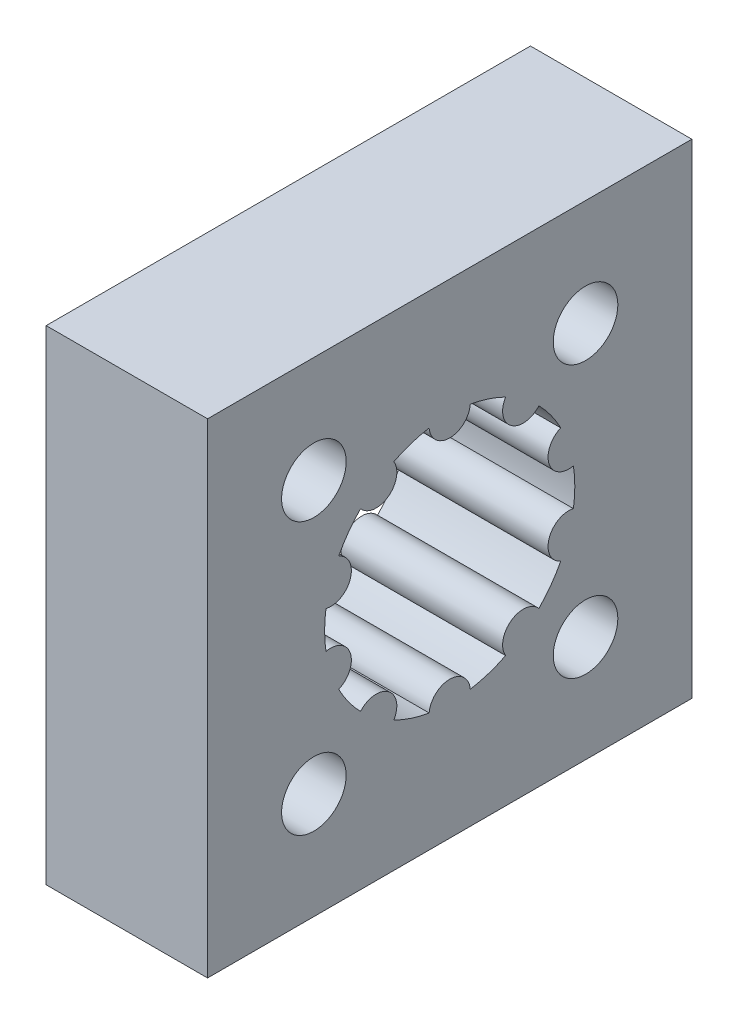
ISO-10303-21;
HEADER;
FILE_DESCRIPTION(('STEP AP214'),'2;1');
FILE_NAME('part.step','',(''),(''),'','','');
FILE_SCHEMA(('AUTOMOTIVE_DESIGN { 1 0 10303 214 1 1 1 1 }'));
ENDSEC;
DATA;
#1=APPLICATION_CONTEXT('core data for automotive mechanical design processes');
#2=APPLICATION_PROTOCOL_DEFINITION('international standard','automotive_design',2000,#1);
#3=PRODUCT_CONTEXT('',#1,'mechanical');
#4=PRODUCT('Part','Part','',(#3));
#5=PRODUCT_RELATED_PRODUCT_CATEGORY('part','',(#4));
#6=PRODUCT_DEFINITION_FORMATION('','',#4);
#7=PRODUCT_DEFINITION_CONTEXT('part definition',#1,'design');
#8=PRODUCT_DEFINITION('design','',#6,#7);
#9=PRODUCT_DEFINITION_SHAPE('','',#8);
#10=(LENGTH_UNIT() NAMED_UNIT(*) SI_UNIT(.MILLI.,.METRE.));
#11=(NAMED_UNIT(*) PLANE_ANGLE_UNIT() SI_UNIT($,.RADIAN.));
#12=(NAMED_UNIT(*) SI_UNIT($,.STERADIAN.) SOLID_ANGLE_UNIT());
#13=UNCERTAINTY_MEASURE_WITH_UNIT(LENGTH_MEASURE(1.E-05),#10,'distance_accuracy_value','');
#14=(GEOMETRIC_REPRESENTATION_CONTEXT(3) GLOBAL_UNCERTAINTY_ASSIGNED_CONTEXT((#13)) GLOBAL_UNIT_ASSIGNED_CONTEXT((#10,
#11,#12)) REPRESENTATION_CONTEXT('',''));
#15=CARTESIAN_POINT('',(0.,0.,0.));
#16=DIRECTION('',(0.,0.,1.));
#17=DIRECTION('',(1.,0.,0.));
#18=AXIS2_PLACEMENT_3D('',#15,#16,#17);
#19=CARTESIAN_POINT('',(10.,0.,0.));
#20=DIRECTION('',(-1.,0.,0.));
#21=DIRECTION('',(0.,0.,1.));
#22=AXIS2_PLACEMENT_3D('',#19,#20,#21);
#23=CYLINDRICAL_SURFACE('',#22,7.75);
#24=CARTESIAN_POINT('',(0.,0.,0.));
#25=DIRECTION('',(1.,0.,0.));
#26=DIRECTION('',(0.,0.,-1.));
#27=AXIS2_PLACEMENT_3D('',#24,#25,#26);
#28=CIRCLE('',#27,7.75);
#29=CARTESIAN_POINT('',(0.,3.57453565804726,6.87642311302531));
#30=VERTEX_POINT('',#29);
#31=CARTESIAN_POINT('',(0.,5.43527474510962,5.5245170327526));
#32=VERTEX_POINT('',#31);
#33=EDGE_CURVE('E254',#30,#32,#28,.F.);
#34=ORIENTED_EDGE('',*,*,#33,.T.);
#35=DIRECTION('',(-1.,0.,0.));
#36=VECTOR('',#35,1.);
#37=CARTESIAN_POINT('',(10.,5.43527474510962,5.5245170327526));
#38=LINE('',#37,#36);
#39=CARTESIAN_POINT('',(10.,5.43527474510962,5.5245170327526));
#40=VERTEX_POINT('',#39);
#41=EDGE_CURVE('E11',#40,#32,#38,.T.);
#42=ORIENTED_EDGE('',*,*,#41,.F.);
#43=CARTESIAN_POINT('',(10.,0.,0.));
#44=DIRECTION('',(1.,0.,0.));
#45=DIRECTION('',(0.,0.,-1.));
#46=AXIS2_PLACEMENT_3D('',#43,#44,#45);
#47=CIRCLE('',#46,7.75);
#48=CARTESIAN_POINT('',(10.,3.57453565804726,6.87642311302531));
#49=VERTEX_POINT('',#48);
#50=EDGE_CURVE('E367',#49,#40,#47,.F.);
#51=ORIENTED_EDGE('',*,*,#50,.F.);
#52=DIRECTION('',(-1.,0.,0.));
#53=VECTOR('',#52,1.);
#54=CARTESIAN_POINT('',(10.,3.57453565804726,6.87642311302531));
#55=LINE('',#54,#53);
#56=EDGE_CURVE('E293',#49,#30,#55,.T.);
#57=ORIENTED_EDGE('',*,*,#56,.T.);
#58=EDGE_LOOP('',(#34,#42,#51,#57));
#59=FACE_BOUND('',#58,.T.);
#60=ADVANCED_FACE('F34',(#59),#23,.F.);
#61=CARTESIAN_POINT('',(10.,6.2698817064059,4.55533570526659));
#62=DIRECTION('',(-1.,0.,0.));
#63=DIRECTION('',(0.,0.,1.));
#64=AXIS2_PLACEMENT_3D('',#61,#62,#63);
#65=CYLINDRICAL_SURFACE('',#64,1.2790157252324);
#66=CARTESIAN_POINT('',(0.,6.2698817064059,4.55533570526659));
#67=DIRECTION('',(1.,0.,0.));
#68=DIRECTION('',(0.,0.,-1.));
#69=AXIS2_PLACEMENT_3D('',#66,#67,#68);
#70=CIRCLE('',#69,1.2790157252324);
#71=CARTESIAN_POINT('',(0.,6.93372018871885,3.46208381535639));
#72=VERTEX_POINT('',#71);
#73=EDGE_CURVE('E257',#32,#72,#70,.T.);
#74=ORIENTED_EDGE('',*,*,#73,.T.);
#75=DIRECTION('',(-1.,0.,0.));
#76=VECTOR('',#75,1.);
#77=CARTESIAN_POINT('',(10.,6.93372018871885,3.46208381535639));
#78=LINE('',#77,#76);
#79=CARTESIAN_POINT('',(10.,6.93372018871885,3.46208381535639));
#80=VERTEX_POINT('',#79);
#81=EDGE_CURVE('E44',#80,#72,#78,.T.);
#82=ORIENTED_EDGE('',*,*,#81,.F.);
#83=CARTESIAN_POINT('',(10.,6.2698817064059,4.55533570526659));
#84=DIRECTION('',(1.,0.,0.));
#85=DIRECTION('',(0.,0.,-1.));
#86=AXIS2_PLACEMENT_3D('',#83,#84,#85);
#87=CIRCLE('',#86,1.2790157252324);
#88=EDGE_CURVE('E375',#40,#80,#87,.T.);
#89=ORIENTED_EDGE('',*,*,#88,.F.);
#90=ORIENTED_EDGE('',*,*,#41,.T.);
#91=EDGE_LOOP('',(#74,#82,#89,#90));
#92=FACE_BOUND('',#91,.T.);
#93=ADVANCED_FACE('F433',(#92),#65,.T.);
#94=CARTESIAN_POINT('',(10.,0.,0.));
#95=DIRECTION('',(-1.,0.,0.));
#96=DIRECTION('',(0.,0.,1.));
#97=AXIS2_PLACEMENT_3D('',#94,#95,#96);
#98=CYLINDRICAL_SURFACE('',#97,7.75);
#99=CARTESIAN_POINT('',(0.,0.,0.));
#100=DIRECTION('',(1.,0.,0.));
#101=DIRECTION('',(0.,0.,-1.));
#102=AXIS2_PLACEMENT_3D('',#99,#100,#101);
#103=CIRCLE('',#102,7.75);
#104=CARTESIAN_POINT('',(0.,7.64445927578118,1.27465382787764));
#105=VERTEX_POINT('',#104);
#106=EDGE_CURVE('E259',#72,#105,#103,.F.);
#107=ORIENTED_EDGE('',*,*,#106,.T.);
#108=DIRECTION('',(-1.,0.,0.));
#109=VECTOR('',#108,1.);
#110=CARTESIAN_POINT('',(10.,7.64445927578118,1.27465382787764));
#111=LINE('',#110,#109);
#112=CARTESIAN_POINT('',(10.,7.64445927578118,1.27465382787764));
#113=VERTEX_POINT('',#112);
#114=EDGE_CURVE('E336',#113,#105,#111,.T.);
#115=ORIENTED_EDGE('',*,*,#114,.F.);
#116=CARTESIAN_POINT('',(10.,0.,0.));
#117=DIRECTION('',(1.,0.,0.));
#118=DIRECTION('',(0.,0.,-1.));
#119=AXIS2_PLACEMENT_3D('',#116,#117,#118);
#120=CIRCLE('',#119,7.75);
#121=EDGE_CURVE('E377',#80,#113,#120,.F.);
#122=ORIENTED_EDGE('',*,*,#121,.F.);
#123=ORIENTED_EDGE('',*,*,#81,.T.);
#124=EDGE_LOOP('',(#107,#115,#122,#123));
#125=FACE_BOUND('',#124,.T.);
#126=ADVANCED_FACE('F438',(#125),#98,.F.);
#127=CARTESIAN_POINT('',(10.,7.75,0.));
#128=DIRECTION('',(-1.,0.,0.));
#129=DIRECTION('',(0.,0.,1.));
#130=AXIS2_PLACEMENT_3D('',#127,#128,#129);
#131=CYLINDRICAL_SURFACE('',#130,1.2790157252324);
#132=CARTESIAN_POINT('',(0.,7.75,0.));
#133=DIRECTION('',(1.,0.,0.));
#134=DIRECTION('',(0.,0.,-1.));
#135=AXIS2_PLACEMENT_3D('',#132,#133,#134);
#136=CIRCLE('',#135,1.2790157252324);
#137=CARTESIAN_POINT('',(0.,7.64445927578118,-1.27465382787764));
#138=VERTEX_POINT('',#137);
#139=EDGE_CURVE('E261',#105,#138,#136,.T.);
#140=ORIENTED_EDGE('',*,*,#139,.T.);
#141=DIRECTION('',(-1.,0.,0.));
#142=VECTOR('',#141,1.);
#143=CARTESIAN_POINT('',(10.,7.64445927578118,-1.27465382787764));
#144=LINE('',#143,#142);
#145=CARTESIAN_POINT('',(10.,7.64445927578118,-1.27465382787764));
#146=VERTEX_POINT('',#145);
#147=EDGE_CURVE('E333',#146,#138,#144,.T.);
#148=ORIENTED_EDGE('',*,*,#147,.F.);
#149=CARTESIAN_POINT('',(10.,7.75,0.));
#150=DIRECTION('',(1.,0.,0.));
#151=DIRECTION('',(0.,0.,-1.));
#152=AXIS2_PLACEMENT_3D('',#149,#150,#151);
#153=CIRCLE('',#152,1.2790157252324);
#154=EDGE_CURVE('E379',#113,#146,#153,.T.);
#155=ORIENTED_EDGE('',*,*,#154,.F.);
#156=ORIENTED_EDGE('',*,*,#114,.T.);
#157=EDGE_LOOP('',(#140,#148,#155,#156));
#158=FACE_BOUND('',#157,.T.);
#159=ADVANCED_FACE('F675',(#158),#131,.T.);
#160=CARTESIAN_POINT('',(10.,0.,0.));
#161=DIRECTION('',(-1.,0.,0.));
#162=DIRECTION('',(0.,0.,1.));
#163=AXIS2_PLACEMENT_3D('',#160,#161,#162);
#164=CYLINDRICAL_SURFACE('',#163,7.75);
#165=CARTESIAN_POINT('',(0.,0.,0.));
#166=DIRECTION('',(1.,0.,0.));
#167=DIRECTION('',(0.,0.,-1.));
#168=AXIS2_PLACEMENT_3D('',#165,#166,#167);
#169=CIRCLE('',#168,7.75);
#170=CARTESIAN_POINT('',(0.,6.9337201887188,-3.46208381535649));
#171=VERTEX_POINT('',#170);
#172=EDGE_CURVE('E263',#138,#171,#169,.F.);
#173=ORIENTED_EDGE('',*,*,#172,.T.);
#174=DIRECTION('',(-1.,0.,0.));
#175=VECTOR('',#174,1.);
#176=CARTESIAN_POINT('',(10.,6.9337201887188,-3.46208381535649));
#177=LINE('',#176,#175);
#178=CARTESIAN_POINT('',(10.,6.9337201887188,-3.46208381535649));
#179=VERTEX_POINT('',#178);
#180=EDGE_CURVE('E330',#179,#171,#177,.T.);
#181=ORIENTED_EDGE('',*,*,#180,.F.);
#182=CARTESIAN_POINT('',(10.,0.,0.));
#183=DIRECTION('',(1.,0.,0.));
#184=DIRECTION('',(0.,0.,-1.));
#185=AXIS2_PLACEMENT_3D('',#182,#183,#184);
#186=CIRCLE('',#185,7.75);
#187=EDGE_CURVE('E381',#146,#179,#186,.F.);
#188=ORIENTED_EDGE('',*,*,#187,.F.);
#189=ORIENTED_EDGE('',*,*,#147,.T.);
#190=EDGE_LOOP('',(#173,#181,#188,#189));
#191=FACE_BOUND('',#190,.T.);
#192=ADVANCED_FACE('F665',(#191),#164,.F.);
#193=CARTESIAN_POINT('',(10.,6.26988170640584,-4.55533570526668));
#194=DIRECTION('',(-1.,0.,0.));
#195=DIRECTION('',(0.,0.,1.));
#196=AXIS2_PLACEMENT_3D('',#193,#194,#195);
#197=CYLINDRICAL_SURFACE('',#196,1.2790157252324);
#198=CARTESIAN_POINT('',(0.,6.26988170640584,-4.55533570526668));
#199=DIRECTION('',(1.,0.,0.));
#200=DIRECTION('',(0.,0.,-1.));
#201=AXIS2_PLACEMENT_3D('',#198,#199,#200);
#202=CIRCLE('',#201,1.2790157252324);
#203=CARTESIAN_POINT('',(0.,5.43527474510954,-5.52451703275267));
#204=VERTEX_POINT('',#203);
#205=EDGE_CURVE('E265',#171,#204,#202,.T.);
#206=ORIENTED_EDGE('',*,*,#205,.T.);
#207=DIRECTION('',(-1.,0.,0.));
#208=VECTOR('',#207,1.);
#209=CARTESIAN_POINT('',(10.,5.43527474510954,-5.52451703275267));
#210=LINE('',#209,#208);
#211=CARTESIAN_POINT('',(10.,5.43527474510954,-5.52451703275267));
#212=VERTEX_POINT('',#211);
#213=EDGE_CURVE('E327',#212,#204,#210,.T.);
#214=ORIENTED_EDGE('',*,*,#213,.F.);
#215=CARTESIAN_POINT('',(10.,6.26988170640584,-4.55533570526668));
#216=DIRECTION('',(1.,0.,0.));
#217=DIRECTION('',(0.,0.,-1.));
#218=AXIS2_PLACEMENT_3D('',#215,#216,#217);
#219=CIRCLE('',#218,1.2790157252324);
#220=EDGE_CURVE('E383',#179,#212,#219,.T.);
#221=ORIENTED_EDGE('',*,*,#220,.F.);
#222=ORIENTED_EDGE('',*,*,#180,.T.);
#223=EDGE_LOOP('',(#206,#214,#221,#222));
#224=FACE_BOUND('',#223,.T.);
#225=ADVANCED_FACE('F655',(#224),#197,.T.);
#226=CARTESIAN_POINT('',(10.,0.,0.));
#227=DIRECTION('',(-1.,0.,0.));
#228=DIRECTION('',(0.,0.,1.));
#229=AXIS2_PLACEMENT_3D('',#226,#227,#228);
#230=CYLINDRICAL_SURFACE('',#229,7.75);
#231=CARTESIAN_POINT('',(0.,0.,0.));
#232=DIRECTION('',(1.,0.,0.));
#233=DIRECTION('',(0.,0.,-1.));
#234=AXIS2_PLACEMENT_3D('',#231,#232,#233);
#235=CIRCLE('',#234,7.75);
#236=CARTESIAN_POINT('',(0.,3.57453565804716,-6.87642311302536));
#237=VERTEX_POINT('',#236);
#238=EDGE_CURVE('E267',#204,#237,#235,.F.);
#239=ORIENTED_EDGE('',*,*,#238,.T.);
#240=DIRECTION('',(-1.,0.,0.));
#241=VECTOR('',#240,1.);
#242=CARTESIAN_POINT('',(10.,3.57453565804716,-6.87642311302536));
#243=LINE('',#242,#241);
#244=CARTESIAN_POINT('',(10.,3.57453565804716,-6.87642311302536));
#245=VERTEX_POINT('',#244);
#246=EDGE_CURVE('E324',#245,#237,#243,.T.);
#247=ORIENTED_EDGE('',*,*,#246,.F.);
#248=CARTESIAN_POINT('',(10.,0.,0.));
#249=DIRECTION('',(1.,0.,0.));
#250=DIRECTION('',(0.,0.,-1.));
#251=AXIS2_PLACEMENT_3D('',#248,#249,#250);
#252=CIRCLE('',#251,7.75);
#253=EDGE_CURVE('E385',#212,#245,#252,.F.);
#254=ORIENTED_EDGE('',*,*,#253,.F.);
#255=ORIENTED_EDGE('',*,*,#213,.T.);
#256=EDGE_LOOP('',(#239,#247,#254,#255));
#257=FACE_BOUND('',#256,.T.);
#258=ADVANCED_FACE('F645',(#257),#230,.F.);
#259=CARTESIAN_POINT('',(10.,2.39488170640582,-7.37068800128745));
#260=DIRECTION('',(-1.,0.,0.));
#261=DIRECTION('',(0.,0.,1.));
#262=AXIS2_PLACEMENT_3D('',#259,#260,#261);
#263=CYLINDRICAL_SURFACE('',#262,1.2790157252324);
#264=CARTESIAN_POINT('',(0.,2.39488170640582,-7.37068800128745));
#265=DIRECTION('',(1.,0.,0.));
#266=DIRECTION('',(0.,0.,-1.));
#267=AXIS2_PLACEMENT_3D('',#264,#265,#266);
#268=CIRCLE('',#267,1.2790157252324);
#269=CARTESIAN_POINT('',(0.,1.14999999999998,-7.6642025025439));
#270=VERTEX_POINT('',#269);
#271=EDGE_CURVE('E269',#237,#270,#268,.T.);
#272=ORIENTED_EDGE('',*,*,#271,.T.);
#273=DIRECTION('',(-1.,0.,0.));
#274=VECTOR('',#273,1.);
#275=CARTESIAN_POINT('',(10.,1.14999999999998,-7.6642025025439));
#276=LINE('',#275,#274);
#277=CARTESIAN_POINT('',(10.,1.14999999999998,-7.6642025025439));
#278=VERTEX_POINT('',#277);
#279=EDGE_CURVE('E321',#278,#270,#276,.T.);
#280=ORIENTED_EDGE('',*,*,#279,.F.);
#281=CARTESIAN_POINT('',(10.,2.39488170640582,-7.37068800128745));
#282=DIRECTION('',(1.,0.,0.));
#283=DIRECTION('',(0.,0.,-1.));
#284=AXIS2_PLACEMENT_3D('',#281,#282,#283);
#285=CIRCLE('',#284,1.2790157252324);
#286=EDGE_CURVE('E387',#245,#278,#285,.T.);
#287=ORIENTED_EDGE('',*,*,#286,.F.);
#288=ORIENTED_EDGE('',*,*,#246,.T.);
#289=EDGE_LOOP('',(#272,#280,#287,#288));
#290=FACE_BOUND('',#289,.T.);
#291=ADVANCED_FACE('F635',(#290),#263,.T.);
#292=CARTESIAN_POINT('',(10.,0.,0.));
#293=DIRECTION('',(-1.,0.,0.));
#294=DIRECTION('',(0.,0.,1.));
#295=AXIS2_PLACEMENT_3D('',#292,#293,#294);
#296=CYLINDRICAL_SURFACE('',#295,7.75);
#297=CARTESIAN_POINT('',(0.,0.,0.));
#298=DIRECTION('',(1.,0.,0.));
#299=DIRECTION('',(0.,0.,-1.));
#300=AXIS2_PLACEMENT_3D('',#297,#298,#299);
#301=CIRCLE('',#300,7.75);
#302=CARTESIAN_POINT('',(0.,-1.15000000000003,-7.66420250254389));
#303=VERTEX_POINT('',#302);
#304=EDGE_CURVE('E271',#270,#303,#301,.F.);
#305=ORIENTED_EDGE('',*,*,#304,.T.);
#306=DIRECTION('',(-1.,0.,0.));
#307=VECTOR('',#306,1.);
#308=CARTESIAN_POINT('',(10.,-1.15000000000003,-7.66420250254389));
#309=LINE('',#308,#307);
#310=CARTESIAN_POINT('',(10.,-1.15000000000003,-7.66420250254389));
#311=VERTEX_POINT('',#310);
#312=EDGE_CURVE('E318',#311,#303,#309,.T.);
#313=ORIENTED_EDGE('',*,*,#312,.F.);
#314=CARTESIAN_POINT('',(10.,0.,0.));
#315=DIRECTION('',(1.,0.,0.));
#316=DIRECTION('',(0.,0.,-1.));
#317=AXIS2_PLACEMENT_3D('',#314,#315,#316);
#318=CIRCLE('',#317,7.75);
#319=EDGE_CURVE('E389',#278,#311,#318,.F.);
#320=ORIENTED_EDGE('',*,*,#319,.F.);
#321=ORIENTED_EDGE('',*,*,#279,.T.);
#322=EDGE_LOOP('',(#305,#313,#320,#321));
#323=FACE_BOUND('',#322,.T.);
#324=ADVANCED_FACE('F625',(#323),#296,.F.);
#325=CARTESIAN_POINT('',(10.,-2.39488170640588,-7.37068800128743));
#326=DIRECTION('',(-1.,0.,0.));
#327=DIRECTION('',(0.,0.,1.));
#328=AXIS2_PLACEMENT_3D('',#325,#326,#327);
#329=CYLINDRICAL_SURFACE('',#328,1.2790157252324);
#330=CARTESIAN_POINT('',(0.,-2.39488170640588,-7.37068800128743));
#331=DIRECTION('',(1.,0.,0.));
#332=DIRECTION('',(0.,0.,-1.));
#333=AXIS2_PLACEMENT_3D('',#330,#331,#332);
#334=CIRCLE('',#333,1.2790157252324);
#335=CARTESIAN_POINT('',(0.,-3.57453565804721,-6.87642311302534));
#336=VERTEX_POINT('',#335);
#337=EDGE_CURVE('E273',#303,#336,#334,.T.);
#338=ORIENTED_EDGE('',*,*,#337,.T.);
#339=DIRECTION('',(-1.,0.,0.));
#340=VECTOR('',#339,1.);
#341=CARTESIAN_POINT('',(10.,-3.57453565804721,-6.87642311302534));
#342=LINE('',#341,#340);
#343=CARTESIAN_POINT('',(10.,-3.57453565804721,-6.87642311302534));
#344=VERTEX_POINT('',#343);
#345=EDGE_CURVE('E315',#344,#336,#342,.T.);
#346=ORIENTED_EDGE('',*,*,#345,.F.);
#347=CARTESIAN_POINT('',(10.,-2.39488170640588,-7.37068800128743));
#348=DIRECTION('',(1.,0.,0.));
#349=DIRECTION('',(0.,0.,-1.));
#350=AXIS2_PLACEMENT_3D('',#347,#348,#349);
#351=CIRCLE('',#350,1.2790157252324);
#352=EDGE_CURVE('E391',#311,#344,#351,.T.);
#353=ORIENTED_EDGE('',*,*,#352,.F.);
#354=ORIENTED_EDGE('',*,*,#312,.T.);
#355=EDGE_LOOP('',(#338,#346,#353,#354));
#356=FACE_BOUND('',#355,.T.);
#357=ADVANCED_FACE('F615',(#356),#329,.T.);
#358=CARTESIAN_POINT('',(10.,0.,0.));
#359=DIRECTION('',(-1.,0.,0.));
#360=DIRECTION('',(0.,0.,1.));
#361=AXIS2_PLACEMENT_3D('',#358,#359,#360);
#362=CYLINDRICAL_SURFACE('',#361,7.75);
#363=CARTESIAN_POINT('',(0.,0.,0.));
#364=DIRECTION('',(1.,0.,0.));
#365=DIRECTION('',(0.,0.,-1.));
#366=AXIS2_PLACEMENT_3D('',#363,#364,#365);
#367=CIRCLE('',#366,7.75);
#368=CARTESIAN_POINT('',(0.,-5.43527474510958,-5.52451703275264));
#369=VERTEX_POINT('',#368);
#370=EDGE_CURVE('E275',#336,#369,#367,.F.);
#371=ORIENTED_EDGE('',*,*,#370,.T.);
#372=DIRECTION('',(-1.,0.,0.));
#373=VECTOR('',#372,1.);
#374=CARTESIAN_POINT('',(10.,-5.43527474510958,-5.52451703275264));
#375=LINE('',#374,#373);
#376=CARTESIAN_POINT('',(10.,-5.43527474510958,-5.52451703275264));
#377=VERTEX_POINT('',#376);
#378=EDGE_CURVE('E312',#377,#369,#375,.T.);
#379=ORIENTED_EDGE('',*,*,#378,.F.);
#380=CARTESIAN_POINT('',(10.,0.,0.));
#381=DIRECTION('',(1.,0.,0.));
#382=DIRECTION('',(0.,0.,-1.));
#383=AXIS2_PLACEMENT_3D('',#380,#381,#382);
#384=CIRCLE('',#383,7.75);
#385=EDGE_CURVE('E393',#344,#377,#384,.F.);
#386=ORIENTED_EDGE('',*,*,#385,.F.);
#387=ORIENTED_EDGE('',*,*,#345,.T.);
#388=EDGE_LOOP('',(#371,#379,#386,#387));
#389=FACE_BOUND('',#388,.T.);
#390=ADVANCED_FACE('F605',(#389),#362,.F.);
#391=CARTESIAN_POINT('',(10.,-6.26988170640587,-4.55533570526663));
#392=DIRECTION('',(-1.,0.,0.));
#393=DIRECTION('',(0.,0.,1.));
#394=AXIS2_PLACEMENT_3D('',#391,#392,#393);
#395=CYLINDRICAL_SURFACE('',#394,1.2790157252324);
#396=CARTESIAN_POINT('',(0.,-6.26988170640587,-4.55533570526663));
#397=DIRECTION('',(1.,0.,0.));
#398=DIRECTION('',(0.,0.,-1.));
#399=AXIS2_PLACEMENT_3D('',#396,#397,#398);
#400=CIRCLE('',#399,1.2790157252324);
#401=CARTESIAN_POINT('',(0.,-6.93372018871882,-3.46208381535645));
#402=VERTEX_POINT('',#401);
#403=EDGE_CURVE('E277',#369,#402,#400,.T.);
#404=ORIENTED_EDGE('',*,*,#403,.T.);
#405=DIRECTION('',(-1.,0.,0.));
#406=VECTOR('',#405,1.);
#407=CARTESIAN_POINT('',(10.,-6.93372018871882,-3.46208381535645));
#408=LINE('',#407,#406);
#409=CARTESIAN_POINT('',(10.,-6.93372018871882,-3.46208381535645));
#410=VERTEX_POINT('',#409);
#411=EDGE_CURVE('E309',#410,#402,#408,.T.);
#412=ORIENTED_EDGE('',*,*,#411,.F.);
#413=CARTESIAN_POINT('',(10.,-6.26988170640587,-4.55533570526663));
#414=DIRECTION('',(1.,0.,0.));
#415=DIRECTION('',(0.,0.,-1.));
#416=AXIS2_PLACEMENT_3D('',#413,#414,#415);
#417=CIRCLE('',#416,1.2790157252324);
#418=EDGE_CURVE('E395',#377,#410,#417,.T.);
#419=ORIENTED_EDGE('',*,*,#418,.F.);
#420=ORIENTED_EDGE('',*,*,#378,.T.);
#421=EDGE_LOOP('',(#404,#412,#419,#420));
#422=FACE_BOUND('',#421,.T.);
#423=ADVANCED_FACE('F595',(#422),#395,.T.);
#424=CARTESIAN_POINT('',(10.,0.,0.));
#425=DIRECTION('',(-1.,0.,0.));
#426=DIRECTION('',(0.,0.,1.));
#427=AXIS2_PLACEMENT_3D('',#424,#425,#426);
#428=CYLINDRICAL_SURFACE('',#427,7.75);
#429=CARTESIAN_POINT('',(0.,0.,0.));
#430=DIRECTION('',(1.,0.,0.));
#431=DIRECTION('',(0.,0.,-1.));
#432=AXIS2_PLACEMENT_3D('',#429,#430,#431);
#433=CIRCLE('',#432,7.75);
#434=CARTESIAN_POINT('',(0.,-7.64445927578119,-1.27465382787759));
#435=VERTEX_POINT('',#434);
#436=EDGE_CURVE('E279',#402,#435,#433,.F.);
#437=ORIENTED_EDGE('',*,*,#436,.T.);
#438=DIRECTION('',(-1.,0.,0.));
#439=VECTOR('',#438,1.);
#440=CARTESIAN_POINT('',(10.,-7.64445927578119,-1.27465382787759));
#441=LINE('',#440,#439);
#442=CARTESIAN_POINT('',(10.,-7.64445927578119,-1.27465382787759));
#443=VERTEX_POINT('',#442);
#444=EDGE_CURVE('E306',#443,#435,#441,.T.);
#445=ORIENTED_EDGE('',*,*,#444,.F.);
#446=CARTESIAN_POINT('',(10.,0.,0.));
#447=DIRECTION('',(1.,0.,0.));
#448=DIRECTION('',(0.,0.,-1.));
#449=AXIS2_PLACEMENT_3D('',#446,#447,#448);
#450=CIRCLE('',#449,7.75);
#451=EDGE_CURVE('E397',#410,#443,#450,.F.);
#452=ORIENTED_EDGE('',*,*,#451,.F.);
#453=ORIENTED_EDGE('',*,*,#411,.T.);
#454=EDGE_LOOP('',(#437,#445,#452,#453));
#455=FACE_BOUND('',#454,.T.);
#456=ADVANCED_FACE('F585',(#455),#428,.F.);
#457=CARTESIAN_POINT('',(10.,-7.75,0.));
#458=DIRECTION('',(-1.,0.,0.));
#459=DIRECTION('',(0.,0.,1.));
#460=AXIS2_PLACEMENT_3D('',#457,#458,#459);
#461=CYLINDRICAL_SURFACE('',#460,1.2790157252324);
#462=CARTESIAN_POINT('',(0.,-7.75,0.));
#463=DIRECTION('',(1.,0.,0.));
#464=DIRECTION('',(0.,0.,-1.));
#465=AXIS2_PLACEMENT_3D('',#462,#463,#464);
#466=CIRCLE('',#465,1.2790157252324);
#467=CARTESIAN_POINT('',(0.,-7.64445927578117,1.27465382787769));
#468=VERTEX_POINT('',#467);
#469=EDGE_CURVE('E281',#435,#468,#466,.T.);
#470=ORIENTED_EDGE('',*,*,#469,.T.);
#471=DIRECTION('',(-1.,0.,0.));
#472=VECTOR('',#471,1.);
#473=CARTESIAN_POINT('',(10.,-7.64445927578117,1.27465382787769));
#474=LINE('',#473,#472);
#475=CARTESIAN_POINT('',(10.,-7.64445927578117,1.27465382787769));
#476=VERTEX_POINT('',#475);
#477=EDGE_CURVE('E303',#476,#468,#474,.T.);
#478=ORIENTED_EDGE('',*,*,#477,.F.);
#479=CARTESIAN_POINT('',(10.,-7.75,0.));
#480=DIRECTION('',(1.,0.,0.));
#481=DIRECTION('',(0.,0.,-1.));
#482=AXIS2_PLACEMENT_3D('',#479,#480,#481);
#483=CIRCLE('',#482,1.2790157252324);
#484=EDGE_CURVE('E399',#443,#476,#483,.T.);
#485=ORIENTED_EDGE('',*,*,#484,.F.);
#486=ORIENTED_EDGE('',*,*,#444,.T.);
#487=EDGE_LOOP('',(#470,#478,#485,#486));
#488=FACE_BOUND('',#487,.T.);
#489=ADVANCED_FACE('F575',(#488),#461,.T.);
#490=CARTESIAN_POINT('',(10.,0.,0.));
#491=DIRECTION('',(-1.,0.,0.));
#492=DIRECTION('',(0.,0.,1.));
#493=AXIS2_PLACEMENT_3D('',#490,#491,#492);
#494=CYLINDRICAL_SURFACE('',#493,7.75);
#495=CARTESIAN_POINT('',(0.,0.,0.));
#496=DIRECTION('',(1.,0.,0.));
#497=DIRECTION('',(0.,0.,-1.));
#498=AXIS2_PLACEMENT_3D('',#495,#496,#497);
#499=CIRCLE('',#498,7.75);
#500=CARTESIAN_POINT('',(0.,-6.93372018871877,3.46208381535654));
#501=VERTEX_POINT('',#500);
#502=EDGE_CURVE('E283',#468,#501,#499,.F.);
#503=ORIENTED_EDGE('',*,*,#502,.T.);
#504=DIRECTION('',(-1.,0.,0.));
#505=VECTOR('',#504,1.);
#506=CARTESIAN_POINT('',(10.,-6.93372018871877,3.46208381535654));
#507=LINE('',#506,#505);
#508=CARTESIAN_POINT('',(10.,-6.93372018871877,3.46208381535654));
#509=VERTEX_POINT('',#508);
#510=EDGE_CURVE('E300',#509,#501,#507,.T.);
#511=ORIENTED_EDGE('',*,*,#510,.F.);
#512=CARTESIAN_POINT('',(10.,0.,0.));
#513=DIRECTION('',(1.,0.,0.));
#514=DIRECTION('',(0.,0.,-1.));
#515=AXIS2_PLACEMENT_3D('',#512,#513,#514);
#516=CIRCLE('',#515,7.75);
#517=EDGE_CURVE('E401',#476,#509,#516,.F.);
#518=ORIENTED_EDGE('',*,*,#517,.F.);
#519=ORIENTED_EDGE('',*,*,#477,.T.);
#520=EDGE_LOOP('',(#503,#511,#518,#519));
#521=FACE_BOUND('',#520,.T.);
#522=ADVANCED_FACE('F566',(#521),#494,.F.);
#523=CARTESIAN_POINT('',(10.,-6.2698817064058,4.55533570526672));
#524=DIRECTION('',(-1.,0.,0.));
#525=DIRECTION('',(0.,0.,1.));
#526=AXIS2_PLACEMENT_3D('',#523,#524,#525);
#527=CYLINDRICAL_SURFACE('',#526,1.2790157252324);
#528=CARTESIAN_POINT('',(0.,-6.2698817064058,4.55533570526672));
#529=DIRECTION('',(1.,0.,0.));
#530=DIRECTION('',(0.,0.,-1.));
#531=AXIS2_PLACEMENT_3D('',#528,#529,#530);
#532=CIRCLE('',#531,1.2790157252324);
#533=CARTESIAN_POINT('',(0.,-5.4352747451095,5.52451703275271));
#534=VERTEX_POINT('',#533);
#535=EDGE_CURVE('E285',#501,#534,#532,.T.);
#536=ORIENTED_EDGE('',*,*,#535,.T.);
#537=DIRECTION('',(-1.,0.,0.));
#538=VECTOR('',#537,1.);
#539=CARTESIAN_POINT('',(10.,-5.4352747451095,5.52451703275271));
#540=LINE('',#539,#538);
#541=CARTESIAN_POINT('',(10.,-5.4352747451095,5.52451703275271));
#542=VERTEX_POINT('',#541);
#543=EDGE_CURVE('E297',#542,#534,#540,.T.);
#544=ORIENTED_EDGE('',*,*,#543,.F.);
#545=CARTESIAN_POINT('',(10.,-6.2698817064058,4.55533570526672));
#546=DIRECTION('',(1.,0.,0.));
#547=DIRECTION('',(0.,0.,-1.));
#548=AXIS2_PLACEMENT_3D('',#545,#546,#547);
#549=CIRCLE('',#548,1.2790157252324);
#550=EDGE_CURVE('E403',#509,#542,#549,.T.);
#551=ORIENTED_EDGE('',*,*,#550,.F.);
#552=ORIENTED_EDGE('',*,*,#510,.T.);
#553=EDGE_LOOP('',(#536,#544,#551,#552));
#554=FACE_BOUND('',#553,.T.);
#555=ADVANCED_FACE('F409',(#554),#527,.T.);
#556=CARTESIAN_POINT('',(10.,0.,0.));
#557=DIRECTION('',(-1.,0.,0.));
#558=DIRECTION('',(0.,0.,1.));
#559=AXIS2_PLACEMENT_3D('',#556,#557,#558);
#560=CYLINDRICAL_SURFACE('',#559,7.75);
#561=CARTESIAN_POINT('',(0.,0.,0.));
#562=DIRECTION('',(1.,0.,0.));
#563=DIRECTION('',(0.,0.,-1.));
#564=AXIS2_PLACEMENT_3D('',#561,#562,#563);
#565=CIRCLE('',#564,7.75);
#566=CARTESIAN_POINT('',(0.,-3.57453565804711,6.87642311302539));
#567=VERTEX_POINT('',#566);
#568=EDGE_CURVE('E287',#534,#567,#565,.F.);
#569=ORIENTED_EDGE('',*,*,#568,.T.);
#570=DIRECTION('',(-1.,0.,0.));
#571=VECTOR('',#570,1.);
#572=CARTESIAN_POINT('',(10.,-3.57453565804711,6.87642311302539));
#573=LINE('',#572,#571);
#574=CARTESIAN_POINT('',(10.,-3.57453565804711,6.87642311302539));
#575=VERTEX_POINT('',#574);
#576=EDGE_CURVE('E221',#575,#567,#573,.T.);
#577=ORIENTED_EDGE('',*,*,#576,.F.);
#578=CARTESIAN_POINT('',(10.,0.,0.));
#579=DIRECTION('',(1.,0.,0.));
#580=DIRECTION('',(0.,0.,-1.));
#581=AXIS2_PLACEMENT_3D('',#578,#579,#580);
#582=CIRCLE('',#581,7.75);
#583=EDGE_CURVE('E212',#542,#575,#582,.F.);
#584=ORIENTED_EDGE('',*,*,#583,.F.);
#585=ORIENTED_EDGE('',*,*,#543,.T.);
#586=EDGE_LOOP('',(#569,#577,#584,#585));
#587=FACE_BOUND('',#586,.T.);
#588=ADVANCED_FACE('F413',(#587),#560,.F.);
#589=CARTESIAN_POINT('',(10.,-2.39488170640577,7.37068800128746));
#590=DIRECTION('',(-1.,0.,0.));
#591=DIRECTION('',(0.,0.,1.));
#592=AXIS2_PLACEMENT_3D('',#589,#590,#591);
#593=CYLINDRICAL_SURFACE('',#592,1.2790157252324);
#594=CARTESIAN_POINT('',(0.,-2.39488170640577,7.37068800128746));
#595=DIRECTION('',(1.,0.,0.));
#596=DIRECTION('',(0.,0.,-1.));
#597=AXIS2_PLACEMENT_3D('',#594,#595,#596);
#598=CIRCLE('',#597,1.2790157252324);
#599=CARTESIAN_POINT('',(0.,-1.14999999999993,7.6642025025439));
#600=VERTEX_POINT('',#599);
#601=EDGE_CURVE('E220',#567,#600,#598,.T.);
#602=ORIENTED_EDGE('',*,*,#601,.T.);
#603=DIRECTION('',(-1.,0.,0.));
#604=VECTOR('',#603,1.);
#605=CARTESIAN_POINT('',(10.,-1.14999999999993,7.6642025025439));
#606=LINE('',#605,#604);
#607=CARTESIAN_POINT('',(10.,-1.14999999999993,7.6642025025439));
#608=VERTEX_POINT('',#607);
#609=EDGE_CURVE('E217',#608,#600,#606,.T.);
#610=ORIENTED_EDGE('',*,*,#609,.F.);
#611=CARTESIAN_POINT('',(10.,-2.39488170640577,7.37068800128746));
#612=DIRECTION('',(1.,0.,0.));
#613=DIRECTION('',(0.,0.,-1.));
#614=AXIS2_PLACEMENT_3D('',#611,#612,#613);
#615=CIRCLE('',#614,1.2790157252324);
#616=EDGE_CURVE('E206',#575,#608,#615,.T.);
#617=ORIENTED_EDGE('',*,*,#616,.F.);
#618=ORIENTED_EDGE('',*,*,#576,.T.);
#619=EDGE_LOOP('',(#602,#610,#617,#618));
#620=FACE_BOUND('',#619,.T.);
#621=ADVANCED_FACE('F218',(#620),#593,.T.);
#622=CARTESIAN_POINT('',(10.,0.,0.));
#623=DIRECTION('',(-1.,0.,0.));
#624=DIRECTION('',(0.,0.,1.));
#625=AXIS2_PLACEMENT_3D('',#622,#623,#624);
#626=CYLINDRICAL_SURFACE('',#625,7.75);
#627=CARTESIAN_POINT('',(0.,0.,0.));
#628=DIRECTION('',(1.,0.,0.));
#629=DIRECTION('',(0.,0.,-1.));
#630=AXIS2_PLACEMENT_3D('',#627,#628,#629);
#631=CIRCLE('',#630,7.75);
#632=CARTESIAN_POINT('',(0.,1.15000000000008,7.66420250254388));
#633=VERTEX_POINT('',#632);
#634=EDGE_CURVE('E130',#600,#633,#631,.F.);
#635=ORIENTED_EDGE('',*,*,#634,.T.);
#636=DIRECTION('',(-1.,0.,0.));
#637=VECTOR('',#636,1.);
#638=CARTESIAN_POINT('',(10.,1.15000000000008,7.66420250254388));
#639=LINE('',#638,#637);
#640=CARTESIAN_POINT('',(10.,1.15000000000008,7.66420250254388));
#641=VERTEX_POINT('',#640);
#642=EDGE_CURVE('E222',#641,#633,#639,.T.);
#643=ORIENTED_EDGE('',*,*,#642,.F.);
#644=CARTESIAN_POINT('',(10.,0.,0.));
#645=DIRECTION('',(1.,0.,0.));
#646=DIRECTION('',(0.,0.,-1.));
#647=AXIS2_PLACEMENT_3D('',#644,#645,#646);
#648=CIRCLE('',#647,7.75);
#649=EDGE_CURVE('E210',#608,#641,#648,.F.);
#650=ORIENTED_EDGE('',*,*,#649,.F.);
#651=ORIENTED_EDGE('',*,*,#609,.T.);
#652=EDGE_LOOP('',(#635,#643,#650,#651));
#653=FACE_BOUND('',#652,.T.);
#654=ADVANCED_FACE('F224',(#653),#626,.F.);
#655=CARTESIAN_POINT('',(10.,0.,-15.));
#656=DIRECTION('',(0.,0.,-1.));
#657=DIRECTION('',(0.,1.,0.));
#658=AXIS2_PLACEMENT_3D('',#655,#656,#657);
#659=PLANE('',#658);
#660=DIRECTION('',(0.,-1.,0.));
#661=VECTOR('',#660,1.);
#662=CARTESIAN_POINT('',(0.,0.,-15.));
#663=LINE('',#662,#661);
#664=CARTESIAN_POINT('',(0.,15.,-15.));
#665=VERTEX_POINT('',#664);
#666=CARTESIAN_POINT('',(0.,-15.,-15.));
#667=VERTEX_POINT('',#666);
#668=EDGE_CURVE('E242',#665,#667,#663,.T.);
#669=ORIENTED_EDGE('',*,*,#668,.F.);
#670=DIRECTION('',(-1.,0.,0.));
#671=VECTOR('',#670,1.);
#672=CARTESIAN_POINT('',(10.,15.,-15.));
#673=LINE('',#672,#671);
#674=CARTESIAN_POINT('',(10.,15.,-15.));
#675=VERTEX_POINT('',#674);
#676=EDGE_CURVE('E38',#675,#665,#673,.T.);
#677=ORIENTED_EDGE('',*,*,#676,.F.);
#678=DIRECTION('',(0.,-1.,0.));
#679=VECTOR('',#678,1.);
#680=CARTESIAN_POINT('',(10.,0.,-15.));
#681=LINE('',#680,#679);
#682=CARTESIAN_POINT('',(10.,-15.,-15.));
#683=VERTEX_POINT('',#682);
#684=EDGE_CURVE('E370',#675,#683,#681,.T.);
#685=ORIENTED_EDGE('',*,*,#684,.T.);
#686=DIRECTION('',(-1.,0.,0.));
#687=VECTOR('',#686,1.);
#688=CARTESIAN_POINT('',(10.,-15.,-15.));
#689=LINE('',#688,#687);
#690=EDGE_CURVE('E226',#683,#667,#689,.T.);
#691=ORIENTED_EDGE('',*,*,#690,.T.);
#692=EDGE_LOOP('',(#669,#677,#685,#691));
#693=FACE_BOUND('',#692,.T.);
#694=ADVANCED_FACE('F354',(#693),#659,.T.);
#695=CARTESIAN_POINT('',(10.,15.,0.));
#696=DIRECTION('',(0.,1.,0.));
#697=DIRECTION('',(0.,0.,1.));
#698=AXIS2_PLACEMENT_3D('',#695,#696,#697);
#699=PLANE('',#698);
#700=DIRECTION('',(0.,0.,-1.));
#701=VECTOR('',#700,1.);
#702=CARTESIAN_POINT('',(0.,15.,0.));
#703=LINE('',#702,#701);
#704=CARTESIAN_POINT('',(0.,15.,15.));
#705=VERTEX_POINT('',#704);
#706=EDGE_CURVE('E245',#705,#665,#703,.T.);
#707=ORIENTED_EDGE('',*,*,#706,.F.);
#708=DIRECTION('',(-1.,0.,0.));
#709=VECTOR('',#708,1.);
#710=CARTESIAN_POINT('',(10.,15.,15.));
#711=LINE('',#710,#709);
#712=CARTESIAN_POINT('',(10.,15.,15.));
#713=VERTEX_POINT('',#712);
#714=EDGE_CURVE('E344',#713,#705,#711,.T.);
#715=ORIENTED_EDGE('',*,*,#714,.F.);
#716=DIRECTION('',(0.,0.,-1.));
#717=VECTOR('',#716,1.);
#718=CARTESIAN_POINT('',(10.,15.,0.));
#719=LINE('',#718,#717);
#720=EDGE_CURVE('E353',#713,#675,#719,.T.);
#721=ORIENTED_EDGE('',*,*,#720,.T.);
#722=ORIENTED_EDGE('',*,*,#676,.T.);
#723=EDGE_LOOP('',(#707,#715,#721,#722));
#724=FACE_BOUND('',#723,.T.);
#725=ADVANCED_FACE('F351',(#724),#699,.T.);
#726=CARTESIAN_POINT('',(10.,0.,15.));
#727=DIRECTION('',(0.,0.,-1.));
#728=DIRECTION('',(0.,1.,0.));
#729=AXIS2_PLACEMENT_3D('',#726,#727,#728);
#730=PLANE('',#729);
#731=DIRECTION('',(0.,-1.,0.));
#732=VECTOR('',#731,1.);
#733=CARTESIAN_POINT('',(0.,0.,15.));
#734=LINE('',#733,#732);
#735=CARTESIAN_POINT('',(0.,-15.,15.));
#736=VERTEX_POINT('',#735);
#737=EDGE_CURVE('E248',#705,#736,#734,.T.);
#738=ORIENTED_EDGE('',*,*,#737,.T.);
#739=DIRECTION('',(-1.,0.,0.));
#740=VECTOR('',#739,1.);
#741=CARTESIAN_POINT('',(10.,-15.,15.));
#742=LINE('',#741,#740);
#743=CARTESIAN_POINT('',(10.,-15.,15.));
#744=VERTEX_POINT('',#743);
#745=EDGE_CURVE('E342',#744,#736,#742,.T.);
#746=ORIENTED_EDGE('',*,*,#745,.F.);
#747=DIRECTION('',(0.,-1.,0.));
#748=VECTOR('',#747,1.);
#749=CARTESIAN_POINT('',(10.,0.,15.));
#750=LINE('',#749,#748);
#751=EDGE_CURVE('E362',#713,#744,#750,.T.);
#752=ORIENTED_EDGE('',*,*,#751,.F.);
#753=ORIENTED_EDGE('',*,*,#714,.T.);
#754=EDGE_LOOP('',(#738,#746,#752,#753));
#755=FACE_BOUND('',#754,.T.);
#756=ADVANCED_FACE('F360',(#755),#730,.F.);
#757=CARTESIAN_POINT('',(10.,-15.,0.));
#758=DIRECTION('',(0.,1.,0.));
#759=DIRECTION('',(0.,0.,1.));
#760=AXIS2_PLACEMENT_3D('',#757,#758,#759);
#761=PLANE('',#760);
#762=DIRECTION('',(0.,0.,-1.));
#763=VECTOR('',#762,1.);
#764=CARTESIAN_POINT('',(0.,-15.,0.));
#765=LINE('',#764,#763);
#766=EDGE_CURVE('E251',#736,#667,#765,.T.);
#767=ORIENTED_EDGE('',*,*,#766,.T.);
#768=ORIENTED_EDGE('',*,*,#690,.F.);
#769=DIRECTION('',(0.,0.,-1.));
#770=VECTOR('',#769,1.);
#771=CARTESIAN_POINT('',(10.,-15.,0.));
#772=LINE('',#771,#770);
#773=EDGE_CURVE('E365',#744,#683,#772,.T.);
#774=ORIENTED_EDGE('',*,*,#773,.F.);
#775=ORIENTED_EDGE('',*,*,#745,.T.);
#776=EDGE_LOOP('',(#767,#768,#774,#775));
#777=FACE_BOUND('',#776,.T.);
#778=ADVANCED_FACE('F364',(#777),#761,.F.);
#779=CARTESIAN_POINT('',(10.,8.41457069611992,-8.41457069611991));
#780=DIRECTION('',(-1.,0.,0.));
#781=DIRECTION('',(0.,0.,1.));
#782=AXIS2_PLACEMENT_3D('',#779,#780,#781);
#783=CYLINDRICAL_SURFACE('',#782,2.);
#784=CARTESIAN_POINT('',(10.,8.41457069611992,-8.41457069611991));
#785=DIRECTION('',(1.,0.,0.));
#786=DIRECTION('',(0.,0.,-1.));
#787=AXIS2_PLACEMENT_3D('',#784,#785,#786);
#788=CIRCLE('',#787,2.);
#789=CARTESIAN_POINT('',(10.,8.41457069611992,-10.4145706961199));
#790=VERTEX_POINT('',#789);
#791=EDGE_CURVE('E750',#790,#790,#788,.T.);
#792=ORIENTED_EDGE('',*,*,#791,.T.);
#793=EDGE_LOOP('',(#792));
#794=FACE_BOUND('',#793,.T.);
#795=CARTESIAN_POINT('',(0.,8.41457069611992,-8.41457069611991));
#796=DIRECTION('',(1.,0.,0.));
#797=DIRECTION('',(0.,0.,-1.));
#798=AXIS2_PLACEMENT_3D('',#795,#796,#797);
#799=CIRCLE('',#798,2.);
#800=CARTESIAN_POINT('',(0.,8.41457069611992,-10.4145706961199));
#801=VERTEX_POINT('',#800);
#802=EDGE_CURVE('E239',#801,#801,#799,.T.);
#803=ORIENTED_EDGE('',*,*,#802,.F.);
#804=EDGE_LOOP('',(#803));
#805=FACE_BOUND('',#804,.T.);
#806=ADVANCED_FACE('F445',(#794,#805),#783,.F.);
#807=CARTESIAN_POINT('',(10.,-8.41457069611991,-8.41457069612038));
#808=DIRECTION('',(-1.,0.,0.));
#809=DIRECTION('',(0.,0.,1.));
#810=AXIS2_PLACEMENT_3D('',#807,#808,#809);
#811=CYLINDRICAL_SURFACE('',#810,1.99999999999988);
#812=CARTESIAN_POINT('',(10.,-8.41457069611991,-8.41457069612038));
#813=DIRECTION('',(1.,0.,0.));
#814=DIRECTION('',(0.,0.,-1.));
#815=AXIS2_PLACEMENT_3D('',#812,#813,#814);
#816=CIRCLE('',#815,1.99999999999988);
#817=CARTESIAN_POINT('',(10.,-8.41457069611991,-10.4145706961203));
#818=VERTEX_POINT('',#817);
#819=EDGE_CURVE('E747',#818,#818,#816,.T.);
#820=ORIENTED_EDGE('',*,*,#819,.T.);
#821=EDGE_LOOP('',(#820));
#822=FACE_BOUND('',#821,.T.);
#823=CARTESIAN_POINT('',(0.,-8.41457069611991,-8.41457069612038));
#824=DIRECTION('',(1.,0.,0.));
#825=DIRECTION('',(0.,0.,-1.));
#826=AXIS2_PLACEMENT_3D('',#823,#824,#825);
#827=CIRCLE('',#826,1.99999999999988);
#828=CARTESIAN_POINT('',(0.,-8.41457069611991,-10.4145706961203));
#829=VERTEX_POINT('',#828);
#830=EDGE_CURVE('E236',#829,#829,#827,.T.);
#831=ORIENTED_EDGE('',*,*,#830,.F.);
#832=EDGE_LOOP('',(#831));
#833=FACE_BOUND('',#832,.T.);
#834=ADVANCED_FACE('F454',(#822,#833),#811,.F.);
#835=CARTESIAN_POINT('',(10.,-8.41457069612039,8.41457069611945));
#836=DIRECTION('',(-1.,0.,0.));
#837=DIRECTION('',(0.,0.,1.));
#838=AXIS2_PLACEMENT_3D('',#835,#836,#837);
#839=CYLINDRICAL_SURFACE('',#838,2.00000000000034);
#840=CARTESIAN_POINT('',(10.,-8.41457069612039,8.41457069611945));
#841=DIRECTION('',(1.,0.,0.));
#842=DIRECTION('',(0.,0.,-1.));
#843=AXIS2_PLACEMENT_3D('',#840,#841,#842);
#844=CIRCLE('',#843,2.00000000000034);
#845=CARTESIAN_POINT('',(10.,-8.41457069612039,6.41457069611911));
#846=VERTEX_POINT('',#845);
#847=EDGE_CURVE('E465',#846,#846,#844,.T.);
#848=ORIENTED_EDGE('',*,*,#847,.T.);
#849=EDGE_LOOP('',(#848));
#850=FACE_BOUND('',#849,.T.);
#851=CARTESIAN_POINT('',(0.,-8.41457069612039,8.41457069611945));
#852=DIRECTION('',(1.,0.,0.));
#853=DIRECTION('',(0.,0.,-1.));
#854=AXIS2_PLACEMENT_3D('',#851,#852,#853);
#855=CIRCLE('',#854,2.00000000000034);
#856=CARTESIAN_POINT('',(0.,-8.41457069612039,6.41457069611911));
#857=VERTEX_POINT('',#856);
#858=EDGE_CURVE('E233',#857,#857,#855,.T.);
#859=ORIENTED_EDGE('',*,*,#858,.F.);
#860=EDGE_LOOP('',(#859));
#861=FACE_BOUND('',#860,.T.);
#862=ADVANCED_FACE('F428',(#850,#861),#839,.F.);
#863=CARTESIAN_POINT('',(10.,8.41457069611945,8.41457069611992));
#864=DIRECTION('',(-1.,0.,0.));
#865=DIRECTION('',(0.,0.,1.));
#866=AXIS2_PLACEMENT_3D('',#863,#864,#865);
#867=CYLINDRICAL_SURFACE('',#866,2.0000000000005);
#868=CARTESIAN_POINT('',(10.,8.41457069611945,8.41457069611992));
#869=DIRECTION('',(1.,0.,0.));
#870=DIRECTION('',(0.,0.,-1.));
#871=AXIS2_PLACEMENT_3D('',#868,#869,#870);
#872=CIRCLE('',#871,2.0000000000005);
#873=CARTESIAN_POINT('',(10.,8.41457069611945,6.41457069611942));
#874=VERTEX_POINT('',#873);
#875=EDGE_CURVE('E292',#874,#874,#872,.T.);
#876=ORIENTED_EDGE('',*,*,#875,.T.);
#877=EDGE_LOOP('',(#876));
#878=FACE_BOUND('',#877,.T.);
#879=CARTESIAN_POINT('',(0.,8.41457069611945,8.41457069611992));
#880=DIRECTION('',(1.,0.,0.));
#881=DIRECTION('',(0.,0.,-1.));
#882=AXIS2_PLACEMENT_3D('',#879,#880,#881);
#883=CIRCLE('',#882,2.0000000000005);
#884=CARTESIAN_POINT('',(0.,8.41457069611945,6.41457069611942));
#885=VERTEX_POINT('',#884);
#886=EDGE_CURVE('E230',#885,#885,#883,.T.);
#887=ORIENTED_EDGE('',*,*,#886,.F.);
#888=EDGE_LOOP('',(#887));
#889=FACE_BOUND('',#888,.T.);
#890=ADVANCED_FACE('F36',(#878,#889),#867,.F.);
#891=CARTESIAN_POINT('',(10.,2.39488170640593,7.37068800128741));
#892=DIRECTION('',(-1.,0.,0.));
#893=DIRECTION('',(0.,0.,1.));
#894=AXIS2_PLACEMENT_3D('',#891,#892,#893);
#895=CYLINDRICAL_SURFACE('',#894,1.2790157252324);
#896=CARTESIAN_POINT('',(0.,2.39488170640593,7.37068800128741));
#897=DIRECTION('',(1.,0.,0.));
#898=DIRECTION('',(0.,0.,-1.));
#899=AXIS2_PLACEMENT_3D('',#896,#897,#898);
#900=CIRCLE('',#899,1.2790157252324);
#901=EDGE_CURVE('E136',#633,#30,#900,.T.);
#902=ORIENTED_EDGE('',*,*,#901,.T.);
#903=ORIENTED_EDGE('',*,*,#56,.F.);
#904=CARTESIAN_POINT('',(10.,2.39488170640593,7.37068800128741));
#905=DIRECTION('',(1.,0.,0.));
#906=DIRECTION('',(0.,0.,-1.));
#907=AXIS2_PLACEMENT_3D('',#904,#905,#906);
#908=CIRCLE('',#907,1.2790157252324);
#909=EDGE_CURVE('E53',#641,#49,#908,.T.);
#910=ORIENTED_EDGE('',*,*,#909,.F.);
#911=ORIENTED_EDGE('',*,*,#642,.T.);
#912=EDGE_LOOP('',(#902,#903,#910,#911));
#913=FACE_BOUND('',#912,.T.);
#914=ADVANCED_FACE('F419',(#913),#895,.T.);
#915=CARTESIAN_POINT('',(10.,0.,0.));
#916=DIRECTION('',(1.,0.,0.));
#917=DIRECTION('',(0.,0.,-1.));
#918=AXIS2_PLACEMENT_3D('',#915,#916,#917);
#919=PLANE('',#918);
#920=ORIENTED_EDGE('',*,*,#875,.F.);
#921=EDGE_LOOP('',(#920));
#922=FACE_BOUND('',#921,.T.);
#923=ORIENTED_EDGE('',*,*,#847,.F.);
#924=EDGE_LOOP('',(#923));
#925=FACE_BOUND('',#924,.T.);
#926=ORIENTED_EDGE('',*,*,#819,.F.);
#927=EDGE_LOOP('',(#926));
#928=FACE_BOUND('',#927,.T.);
#929=ORIENTED_EDGE('',*,*,#791,.F.);
#930=EDGE_LOOP('',(#929));
#931=FACE_BOUND('',#930,.T.);
#932=ORIENTED_EDGE('',*,*,#684,.F.);
#933=ORIENTED_EDGE('',*,*,#720,.F.);
#934=ORIENTED_EDGE('',*,*,#751,.T.);
#935=ORIENTED_EDGE('',*,*,#773,.T.);
#936=EDGE_LOOP('',(#932,#933,#934,#935));
#937=FACE_BOUND('',#936,.T.);
#938=ORIENTED_EDGE('',*,*,#50,.T.);
#939=ORIENTED_EDGE('',*,*,#88,.T.);
#940=ORIENTED_EDGE('',*,*,#121,.T.);
#941=ORIENTED_EDGE('',*,*,#154,.T.);
#942=ORIENTED_EDGE('',*,*,#187,.T.);
#943=ORIENTED_EDGE('',*,*,#220,.T.);
#944=ORIENTED_EDGE('',*,*,#253,.T.);
#945=ORIENTED_EDGE('',*,*,#286,.T.);
#946=ORIENTED_EDGE('',*,*,#319,.T.);
#947=ORIENTED_EDGE('',*,*,#352,.T.);
#948=ORIENTED_EDGE('',*,*,#385,.T.);
#949=ORIENTED_EDGE('',*,*,#418,.T.);
#950=ORIENTED_EDGE('',*,*,#451,.T.);
#951=ORIENTED_EDGE('',*,*,#484,.T.);
#952=ORIENTED_EDGE('',*,*,#517,.T.);
#953=ORIENTED_EDGE('',*,*,#550,.T.);
#954=ORIENTED_EDGE('',*,*,#583,.T.);
#955=ORIENTED_EDGE('',*,*,#616,.T.);
#956=ORIENTED_EDGE('',*,*,#649,.T.);
#957=ORIENTED_EDGE('',*,*,#909,.T.);
#958=EDGE_LOOP('',(#938,#939,#940,#941,#942,#943,#944,#945,#946,#947,#948,#949,#950,#951,#952,
#953,#954,#955,#956,#957));
#959=FACE_BOUND('',#958,.T.);
#960=ADVANCED_FACE('F208',(#922,#925,#928,#931,#937,#959),#919,.T.);
#961=CARTESIAN_POINT('',(0.,0.,0.));
#962=DIRECTION('',(1.,0.,0.));
#963=DIRECTION('',(0.,0.,-1.));
#964=AXIS2_PLACEMENT_3D('',#961,#962,#963);
#965=PLANE('',#964);
#966=ORIENTED_EDGE('',*,*,#886,.T.);
#967=EDGE_LOOP('',(#966));
#968=FACE_BOUND('',#967,.T.);
#969=ORIENTED_EDGE('',*,*,#858,.T.);
#970=EDGE_LOOP('',(#969));
#971=FACE_BOUND('',#970,.T.);
#972=ORIENTED_EDGE('',*,*,#830,.T.);
#973=EDGE_LOOP('',(#972));
#974=FACE_BOUND('',#973,.T.);
#975=ORIENTED_EDGE('',*,*,#802,.T.);
#976=EDGE_LOOP('',(#975));
#977=FACE_BOUND('',#976,.T.);
#978=ORIENTED_EDGE('',*,*,#668,.T.);
#979=ORIENTED_EDGE('',*,*,#766,.F.);
#980=ORIENTED_EDGE('',*,*,#737,.F.);
#981=ORIENTED_EDGE('',*,*,#706,.T.);
#982=EDGE_LOOP('',(#978,#979,#980,#981));
#983=FACE_BOUND('',#982,.T.);
#984=ORIENTED_EDGE('',*,*,#33,.F.);
#985=ORIENTED_EDGE('',*,*,#901,.F.);
#986=ORIENTED_EDGE('',*,*,#634,.F.);
#987=ORIENTED_EDGE('',*,*,#601,.F.);
#988=ORIENTED_EDGE('',*,*,#568,.F.);
#989=ORIENTED_EDGE('',*,*,#535,.F.);
#990=ORIENTED_EDGE('',*,*,#502,.F.);
#991=ORIENTED_EDGE('',*,*,#469,.F.);
#992=ORIENTED_EDGE('',*,*,#436,.F.);
#993=ORIENTED_EDGE('',*,*,#403,.F.);
#994=ORIENTED_EDGE('',*,*,#370,.F.);
#995=ORIENTED_EDGE('',*,*,#337,.F.);
#996=ORIENTED_EDGE('',*,*,#304,.F.);
#997=ORIENTED_EDGE('',*,*,#271,.F.);
#998=ORIENTED_EDGE('',*,*,#238,.F.);
#999=ORIENTED_EDGE('',*,*,#205,.F.);
#1000=ORIENTED_EDGE('',*,*,#172,.F.);
#1001=ORIENTED_EDGE('',*,*,#139,.F.);
#1002=ORIENTED_EDGE('',*,*,#106,.F.);
#1003=ORIENTED_EDGE('',*,*,#73,.F.);
#1004=EDGE_LOOP('',(#984,#985,#986,#987,#988,#989,#990,#991,#992,#993,#994,#995,#996,#997,#998,
#999,#1000,#1001,#1002,#1003));
#1005=FACE_BOUND('',#1004,.T.);
#1006=ADVANCED_FACE('F357',(#968,#971,#974,#977,#983,#1005),#965,.F.);
#1007=CLOSED_SHELL('',(#60,#93,#126,#159,#192,#225,#258,#291,#324,#357,#390,#423,#456,#489,#522,
#555,#588,#621,#654,#694,#725,#756,#778,#806,#834,#862,#890,#914,#960,#1006));
#1008=MANIFOLD_SOLID_BREP('B2',#1007);
#1009=ADVANCED_BREP_SHAPE_REPRESENTATION('',(#18,#1008),#14);
#1010=SHAPE_DEFINITION_REPRESENTATION(#9,#1009);
ENDSEC;
END-ISO-10303-21;
